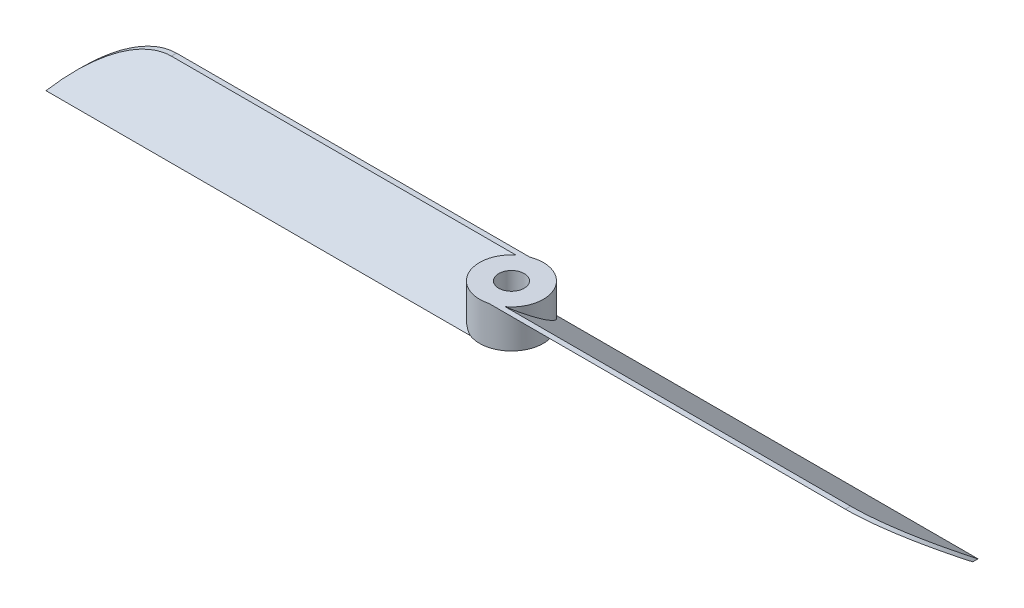
ISO-10303-21;
HEADER;
FILE_DESCRIPTION(('STEP AP214'),'2;1');
FILE_NAME('part.step','',(''),(''),'','','');
FILE_SCHEMA(('AUTOMOTIVE_DESIGN { 1 0 10303 214 1 1 1 1 }'));
ENDSEC;
DATA;
#1=APPLICATION_CONTEXT('core data for automotive mechanical design processes');
#2=APPLICATION_PROTOCOL_DEFINITION('international standard','automotive_design',2000,#1);
#3=PRODUCT_CONTEXT('',#1,'mechanical');
#4=PRODUCT('Part','Part','',(#3));
#5=PRODUCT_RELATED_PRODUCT_CATEGORY('part','',(#4));
#6=PRODUCT_DEFINITION_FORMATION('','',#4);
#7=PRODUCT_DEFINITION_CONTEXT('part definition',#1,'design');
#8=PRODUCT_DEFINITION('design','',#6,#7);
#9=PRODUCT_DEFINITION_SHAPE('','',#8);
#10=(LENGTH_UNIT() NAMED_UNIT(*) SI_UNIT(.MILLI.,.METRE.));
#11=(NAMED_UNIT(*) PLANE_ANGLE_UNIT() SI_UNIT($,.RADIAN.));
#12=(NAMED_UNIT(*) SI_UNIT($,.STERADIAN.) SOLID_ANGLE_UNIT());
#13=UNCERTAINTY_MEASURE_WITH_UNIT(LENGTH_MEASURE(1.E-05),#10,'distance_accuracy_value','');
#14=(GEOMETRIC_REPRESENTATION_CONTEXT(3) GLOBAL_UNCERTAINTY_ASSIGNED_CONTEXT((#13)) GLOBAL_UNIT_ASSIGNED_CONTEXT((#10,
#11,#12)) REPRESENTATION_CONTEXT('',''));
#15=CARTESIAN_POINT('',(0.,0.,0.));
#16=DIRECTION('',(0.,0.,1.));
#17=DIRECTION('',(1.,0.,0.));
#18=AXIS2_PLACEMENT_3D('',#15,#16,#17);
#19=CARTESIAN_POINT('',(0.,9.,0.));
#20=DIRECTION('',(0.,-1.,0.));
#21=DIRECTION('',(0.,0.,-1.));
#22=AXIS2_PLACEMENT_3D('',#19,#20,#21);
#23=CYLINDRICAL_SURFACE('',#22,7.5);
#24=CARTESIAN_POINT('',(0.,4.92803483303225,0.));
#25=DIRECTION('',(0.,-0.81769046112569,-0.575658153580801));
#26=DIRECTION('',(0.,-0.575658153580801,0.81769046112569));
#27=AXIS2_PLACEMENT_3D('',#24,#25,#26);
#28=ELLIPSE('',#27,9.17217499354827,7.5);
#29=CARTESIAN_POINT('',(-4.77444632114982,9.,-5.78400054689304));
#30=VERTEX_POINT('',#29);
#31=CARTESIAN_POINT('',(-2.69258240356727,0.,6.99999999999999));
#32=VERTEX_POINT('',#31);
#33=EDGE_CURVE('E125',#30,#32,#28,.F.);
#34=ORIENTED_EDGE('',*,*,#33,.T.);
#35=CARTESIAN_POINT('',(0.,0.,0.));
#36=DIRECTION('',(0.,1.,0.));
#37=DIRECTION('',(0.,0.,1.));
#38=AXIS2_PLACEMENT_3D('',#35,#36,#37);
#39=CIRCLE('',#38,7.5);
#40=CARTESIAN_POINT('',(4.5,0.,-6.));
#41=VERTEX_POINT('',#40);
#42=EDGE_CURVE('E115',#32,#41,#39,.T.);
#43=ORIENTED_EDGE('',*,*,#42,.T.);
#44=CARTESIAN_POINT('',(0.,4.07684926060632,0.));
#45=DIRECTION('',(0.,-0.827128414100151,0.56201297724178));
#46=DIRECTION('',(0.,-0.56201297724178,-0.827128414100151));
#47=AXIS2_PLACEMENT_3D('',#44,#45,#46);
#48=ELLIPSE('',#47,9.06751584415026,7.5);
#49=CARTESIAN_POINT('',(1.93711093191951,9.,7.24552284083443));
#50=VERTEX_POINT('',#49);
#51=EDGE_CURVE('E128',#50,#41,#48,.F.);
#52=ORIENTED_EDGE('',*,*,#51,.F.);
#53=CARTESIAN_POINT('',(0.,9.,0.));
#54=DIRECTION('',(0.,1.,0.));
#55=DIRECTION('',(0.,0.,1.));
#56=AXIS2_PLACEMENT_3D('',#53,#54,#55);
#57=CIRCLE('',#56,7.5);
#58=EDGE_CURVE('E157',#30,#50,#57,.T.);
#59=ORIENTED_EDGE('',*,*,#58,.F.);
#60=EDGE_LOOP('',(#34,#43,#52,#59));
#61=FACE_BOUND('',#60,.T.);
#62=ADVANCED_FACE('F32',(#61),#23,.T.);
#63=CARTESIAN_POINT('',(0.,4.07196516696775,0.));
#64=DIRECTION('',(0.,0.81769046112569,0.575658153580801));
#65=DIRECTION('',(0.,-0.575658153580801,0.81769046112569));
#66=AXIS2_PLACEMENT_3D('',#63,#64,#65);
#67=ELLIPSE('',#66,9.17217499354826,7.5);
#68=CARTESIAN_POINT('',(-4.77444632116431,0.,5.78400054677286));
#69=VERTEX_POINT('',#68);
#70=CARTESIAN_POINT('',(-2.69258240356727,9.,-6.99999999999999));
#71=VERTEX_POINT('',#70);
#72=EDGE_CURVE('E126',#69,#71,#67,.F.);
#73=ORIENTED_EDGE('',*,*,#72,.T.);
#74=CARTESIAN_POINT('',(4.4999999997799,9.,6.));
#75=VERTEX_POINT('',#74);
#76=EDGE_CURVE('E153',#75,#71,#57,.T.);
#77=ORIENTED_EDGE('',*,*,#76,.F.);
#78=CARTESIAN_POINT('',(0.,4.92315073939368,0.));
#79=DIRECTION('',(0.,0.827128414100151,-0.56201297724178));
#80=DIRECTION('',(0.,-0.56201297724178,-0.827128414100151));
#81=AXIS2_PLACEMENT_3D('',#78,#79,#80);
#82=ELLIPSE('',#81,9.06751584415026,7.5);
#83=CARTESIAN_POINT('',(1.93711093201874,0.,-7.24552284083444));
#84=VERTEX_POINT('',#83);
#85=EDGE_CURVE('E138',#84,#75,#82,.F.);
#86=ORIENTED_EDGE('',*,*,#85,.F.);
#87=EDGE_CURVE('E158',#84,#69,#39,.T.);
#88=ORIENTED_EDGE('',*,*,#87,.T.);
#89=EDGE_LOOP('',(#73,#77,#86,#88));
#90=FACE_BOUND('',#89,.T.);
#91=ADVANCED_FACE('F184',(#90),#23,.T.);
#92=CARTESIAN_POINT('',(0.,9.,0.));
#93=DIRECTION('',(0.,1.,0.));
#94=DIRECTION('',(0.,0.,1.));
#95=AXIS2_PLACEMENT_3D('',#92,#93,#94);
#96=PLANE('',#95);
#97=DIRECTION('',(1.,0.,0.));
#98=VECTOR('',#97,1.);
#99=CARTESIAN_POINT('',(-500000.,9.,7.24552284083443));
#100=LINE('',#99,#98);
#101=CARTESIAN_POINT('',(85.7967069114238,9.,7.24552284083443));
#102=VERTEX_POINT('',#101);
#103=EDGE_CURVE('E135',#50,#102,#100,.T.);
#104=ORIENTED_EDGE('',*,*,#103,.T.);
#105=DIRECTION('',(0.,0.,-1.));
#106=VECTOR('',#105,1.);
#107=CARTESIAN_POINT('',(85.7967069115099,9.,6.));
#108=LINE('',#107,#106);
#109=CARTESIAN_POINT('',(85.7967069115099,9.,6.));
#110=VERTEX_POINT('',#109);
#111=EDGE_CURVE('E47',#102,#110,#108,.T.);
#112=ORIENTED_EDGE('',*,*,#111,.T.);
#113=DIRECTION('',(1.,0.,0.));
#114=VECTOR('',#113,1.);
#115=CARTESIAN_POINT('',(-500000.,9.,6.));
#116=LINE('',#115,#114);
#117=EDGE_CURVE('E134',#75,#110,#116,.T.);
#118=ORIENTED_EDGE('',*,*,#117,.F.);
#119=ORIENTED_EDGE('',*,*,#76,.T.);
#120=DIRECTION('',(-1.,0.,0.));
#121=VECTOR('',#120,1.);
#122=CARTESIAN_POINT('',(500000.,9.,-7.));
#123=LINE('',#122,#121);
#124=CARTESIAN_POINT('',(-85.7967069115099,9.,-7.));
#125=VERTEX_POINT('',#124);
#126=EDGE_CURVE('E118',#71,#125,#123,.T.);
#127=ORIENTED_EDGE('',*,*,#126,.T.);
#128=DIRECTION('',(0.,0.,-1.));
#129=VECTOR('',#128,1.);
#130=CARTESIAN_POINT('',(-85.7967069115099,9.,-5.78400054677286));
#131=LINE('',#130,#129);
#132=CARTESIAN_POINT('',(-85.7967069115099,9.,-5.78400054677286));
#133=VERTEX_POINT('',#132);
#134=EDGE_CURVE('E161',#125,#133,#131,.F.);
#135=ORIENTED_EDGE('',*,*,#134,.T.);
#136=DIRECTION('',(-1.,0.,0.));
#137=VECTOR('',#136,1.);
#138=CARTESIAN_POINT('',(500000.,9.,-5.78400054677286));
#139=LINE('',#138,#137);
#140=EDGE_CURVE('E103',#30,#133,#139,.T.);
#141=ORIENTED_EDGE('',*,*,#140,.F.);
#142=ORIENTED_EDGE('',*,*,#58,.T.);
#143=EDGE_LOOP('',(#104,#112,#118,#119,#127,#135,#141,#142));
#144=FACE_BOUND('',#143,.T.);
#145=CARTESIAN_POINT('',(0.,9.,0.));
#146=DIRECTION('',(0.,1.,0.));
#147=DIRECTION('',(0.,0.,1.));
#148=AXIS2_PLACEMENT_3D('',#145,#146,#147);
#149=CIRCLE('',#148,3.);
#150=CARTESIAN_POINT('',(0.,9.,3.));
#151=VERTEX_POINT('',#150);
#152=EDGE_CURVE('E148',#151,#151,#149,.T.);
#153=ORIENTED_EDGE('',*,*,#152,.F.);
#154=EDGE_LOOP('',(#153));
#155=FACE_BOUND('',#154,.T.);
#156=ADVANCED_FACE('F176',(#144,#155),#96,.T.);
#157=CARTESIAN_POINT('',(0.,0.,0.));
#158=DIRECTION('',(0.,1.,0.));
#159=DIRECTION('',(0.,0.,1.));
#160=AXIS2_PLACEMENT_3D('',#157,#158,#159);
#161=PLANE('',#160);
#162=ORIENTED_EDGE('',*,*,#87,.F.);
#163=DIRECTION('',(1.,0.,0.));
#164=VECTOR('',#163,1.);
#165=CARTESIAN_POINT('',(-500000.,0.,-7.24552284083443));
#166=LINE('',#165,#164);
#167=CARTESIAN_POINT('',(102.5,0.,-7.24552284083443));
#168=VERTEX_POINT('',#167);
#169=EDGE_CURVE('E141',#84,#168,#166,.T.);
#170=ORIENTED_EDGE('',*,*,#169,.T.);
#171=DIRECTION('',(0.,0.,-1.));
#172=VECTOR('',#171,1.);
#173=CARTESIAN_POINT('',(102.5,0.,-6.));
#174=LINE('',#173,#172);
#175=CARTESIAN_POINT('',(102.5,0.,-6.));
#176=VERTEX_POINT('',#175);
#177=EDGE_CURVE('E130',#176,#168,#174,.T.);
#178=ORIENTED_EDGE('',*,*,#177,.F.);
#179=DIRECTION('',(1.,0.,0.));
#180=VECTOR('',#179,1.);
#181=CARTESIAN_POINT('',(-500000.,0.,-6.));
#182=LINE('',#181,#180);
#183=EDGE_CURVE('E137',#41,#176,#182,.T.);
#184=ORIENTED_EDGE('',*,*,#183,.F.);
#185=ORIENTED_EDGE('',*,*,#42,.F.);
#186=DIRECTION('',(-1.,0.,0.));
#187=VECTOR('',#186,1.);
#188=CARTESIAN_POINT('',(500000.,0.,6.99999999999999));
#189=LINE('',#188,#187);
#190=CARTESIAN_POINT('',(-102.5,0.,6.99999999999999));
#191=VERTEX_POINT('',#190);
#192=EDGE_CURVE('E101',#32,#191,#189,.T.);
#193=ORIENTED_EDGE('',*,*,#192,.T.);
#194=DIRECTION('',(0.,0.,-1.));
#195=VECTOR('',#194,1.);
#196=CARTESIAN_POINT('',(-102.5,0.,6.99999999999999));
#197=LINE('',#196,#195);
#198=CARTESIAN_POINT('',(-102.5,0.,5.78400054677286));
#199=VERTEX_POINT('',#198);
#200=EDGE_CURVE('E112',#191,#199,#197,.T.);
#201=ORIENTED_EDGE('',*,*,#200,.T.);
#202=DIRECTION('',(-1.,0.,0.));
#203=VECTOR('',#202,1.);
#204=CARTESIAN_POINT('',(500000.,0.,5.78400054677286));
#205=LINE('',#204,#203);
#206=EDGE_CURVE('E116',#69,#199,#205,.T.);
#207=ORIENTED_EDGE('',*,*,#206,.F.);
#208=EDGE_LOOP('',(#162,#170,#178,#184,#185,#193,#201,#207));
#209=FACE_BOUND('',#208,.T.);
#210=CARTESIAN_POINT('',(0.,0.,0.));
#211=DIRECTION('',(0.,1.,0.));
#212=DIRECTION('',(0.,0.,1.));
#213=AXIS2_PLACEMENT_3D('',#210,#211,#212);
#214=CIRCLE('',#213,3.);
#215=CARTESIAN_POINT('',(0.,0.,3.));
#216=VERTEX_POINT('',#215);
#217=EDGE_CURVE('E133',#216,#216,#214,.T.);
#218=ORIENTED_EDGE('',*,*,#217,.T.);
#219=EDGE_LOOP('',(#218));
#220=FACE_BOUND('',#219,.T.);
#221=ADVANCED_FACE('F109',(#209,#220),#161,.F.);
#222=CARTESIAN_POINT('',(0.,9.,0.));
#223=DIRECTION('',(0.,-1.,0.));
#224=DIRECTION('',(0.,0.,-1.));
#225=AXIS2_PLACEMENT_3D('',#222,#223,#224);
#226=CYLINDRICAL_SURFACE('',#225,3.);
#227=ORIENTED_EDGE('',*,*,#152,.T.);
#228=EDGE_LOOP('',(#227));
#229=FACE_BOUND('',#228,.T.);
#230=ORIENTED_EDGE('',*,*,#217,.F.);
#231=EDGE_LOOP('',(#230));
#232=FACE_BOUND('',#231,.T.);
#233=ADVANCED_FACE('F206',(#229,#232),#226,.F.);
#234=CARTESIAN_POINT('',(-500000.,9.,7.24552284083443));
#235=DIRECTION('',(0.,-0.827128414100151,0.56201297724178));
#236=DIRECTION('',(0.,-0.56201297724178,-0.827128414100151));
#237=AXIS2_PLACEMENT_3D('',#234,#235,#236);
#238=PLANE('',#237);
#239=ORIENTED_EDGE('',*,*,#183,.T.);
#240=CARTESIAN_POINT('',(85.7967069115099,-11.,-22.1889723610199));
#241=DIRECTION('',(0.,-0.827128414100151,0.56201297724178));
#242=DIRECTION('',(0.,0.56201297724178,0.827128414100151));
#243=AXIS2_PLACEMENT_3D('',#240,#241,#242);
#244=ELLIPSE('',#243,35.5863668809839,20.);
#245=EDGE_CURVE('E156',#176,#102,#244,.T.);
#246=ORIENTED_EDGE('',*,*,#245,.T.);
#247=ORIENTED_EDGE('',*,*,#103,.F.);
#248=ORIENTED_EDGE('',*,*,#51,.T.);
#249=EDGE_LOOP('',(#239,#246,#247,#248));
#250=FACE_BOUND('',#249,.T.);
#251=ADVANCED_FACE('F173',(#250),#238,.T.);
#252=CARTESIAN_POINT('',(-500000.,9.,6.));
#253=DIRECTION('',(0.,0.827128414100151,-0.56201297724178));
#254=DIRECTION('',(0.,0.56201297724178,0.827128414100151));
#255=AXIS2_PLACEMENT_3D('',#252,#253,#254);
#256=PLANE('',#255);
#257=ORIENTED_EDGE('',*,*,#117,.T.);
#258=CARTESIAN_POINT('',(85.7967069115099,-11.,-23.4344952018543));
#259=DIRECTION('',(0.,0.827128414100151,-0.56201297724178));
#260=DIRECTION('',(0.,0.56201297724178,0.827128414100151));
#261=AXIS2_PLACEMENT_3D('',#258,#259,#260);
#262=ELLIPSE('',#261,35.5863668809839,20.);
#263=EDGE_CURVE('E104',#110,#168,#262,.T.);
#264=ORIENTED_EDGE('',*,*,#263,.T.);
#265=ORIENTED_EDGE('',*,*,#169,.F.);
#266=ORIENTED_EDGE('',*,*,#85,.T.);
#267=EDGE_LOOP('',(#257,#264,#265,#266));
#268=FACE_BOUND('',#267,.T.);
#269=ADVANCED_FACE('F166',(#268),#256,.T.);
#270=CARTESIAN_POINT('',(500000.,9.,-5.78400054677286));
#271=DIRECTION('',(0.,-0.81769046112569,-0.575658153580801));
#272=DIRECTION('',(0.,0.575658153580801,-0.81769046112569));
#273=AXIS2_PLACEMENT_3D('',#270,#271,#272);
#274=PLANE('',#273);
#275=ORIENTED_EDGE('',*,*,#140,.T.);
#276=CARTESIAN_POINT('',(-85.7967069115099,-11.,22.6248895571668));
#277=DIRECTION('',(0.,-0.81769046112569,-0.575658153580801));
#278=DIRECTION('',(0.,-0.575658153580801,0.81769046112569));
#279=AXIS2_PLACEMENT_3D('',#276,#277,#278);
#280=ELLIPSE('',#279,34.7428415207755,20.);
#281=EDGE_CURVE('E40',#133,#191,#280,.F.);
#282=ORIENTED_EDGE('',*,*,#281,.T.);
#283=ORIENTED_EDGE('',*,*,#192,.F.);
#284=ORIENTED_EDGE('',*,*,#33,.F.);
#285=EDGE_LOOP('',(#275,#282,#283,#284));
#286=FACE_BOUND('',#285,.T.);
#287=ADVANCED_FACE('F99',(#286),#274,.F.);
#288=CARTESIAN_POINT('',(500000.,0.,5.78400054677286));
#289=DIRECTION('',(0.,0.81769046112569,0.575658153580801));
#290=DIRECTION('',(0.,-0.575658153580801,0.81769046112569));
#291=AXIS2_PLACEMENT_3D('',#288,#289,#290);
#292=PLANE('',#291);
#293=ORIENTED_EDGE('',*,*,#206,.T.);
#294=CARTESIAN_POINT('',(-85.7967069115099,-11.,21.4088901039397));
#295=DIRECTION('',(0.,0.81769046112569,0.575658153580801));
#296=DIRECTION('',(0.,-0.575658153580801,0.81769046112569));
#297=AXIS2_PLACEMENT_3D('',#294,#295,#296);
#298=ELLIPSE('',#297,34.7428415207755,20.);
#299=EDGE_CURVE('E11',#199,#125,#298,.F.);
#300=ORIENTED_EDGE('',*,*,#299,.T.);
#301=ORIENTED_EDGE('',*,*,#126,.F.);
#302=ORIENTED_EDGE('',*,*,#72,.F.);
#303=EDGE_LOOP('',(#293,#300,#301,#302));
#304=FACE_BOUND('',#303,.T.);
#305=ADVANCED_FACE('F182',(#304),#292,.F.);
#306=CARTESIAN_POINT('',(85.7967069115099,-11.,0.));
#307=DIRECTION('',(0.,0.,1.));
#308=DIRECTION('',(1.,0.,0.));
#309=AXIS2_PLACEMENT_3D('',#306,#307,#308);
#310=CYLINDRICAL_SURFACE('',#309,20.);
#311=ORIENTED_EDGE('',*,*,#263,.F.);
#312=ORIENTED_EDGE('',*,*,#111,.F.);
#313=ORIENTED_EDGE('',*,*,#245,.F.);
#314=ORIENTED_EDGE('',*,*,#177,.T.);
#315=EDGE_LOOP('',(#311,#312,#313,#314));
#316=FACE_BOUND('',#315,.T.);
#317=ADVANCED_FACE('F170',(#316),#310,.T.);
#318=CARTESIAN_POINT('',(-85.7967069115099,-11.,0.));
#319=DIRECTION('',(0.,0.,1.));
#320=DIRECTION('',(1.,0.,0.));
#321=AXIS2_PLACEMENT_3D('',#318,#319,#320);
#322=CYLINDRICAL_SURFACE('',#321,20.);
#323=ORIENTED_EDGE('',*,*,#299,.F.);
#324=ORIENTED_EDGE('',*,*,#200,.F.);
#325=ORIENTED_EDGE('',*,*,#281,.F.);
#326=ORIENTED_EDGE('',*,*,#134,.F.);
#327=EDGE_LOOP('',(#323,#324,#325,#326));
#328=FACE_BOUND('',#327,.T.);
#329=ADVANCED_FACE('F34',(#328),#322,.T.);
#330=CLOSED_SHELL('',(#62,#91,#156,#221,#233,#251,#269,#287,#305,#317,#329));
#331=MANIFOLD_SOLID_BREP('B2',#330);
#332=ADVANCED_BREP_SHAPE_REPRESENTATION('',(#18,#331),#14);
#333=SHAPE_DEFINITION_REPRESENTATION(#9,#332);
ENDSEC;
END-ISO-10303-21;
